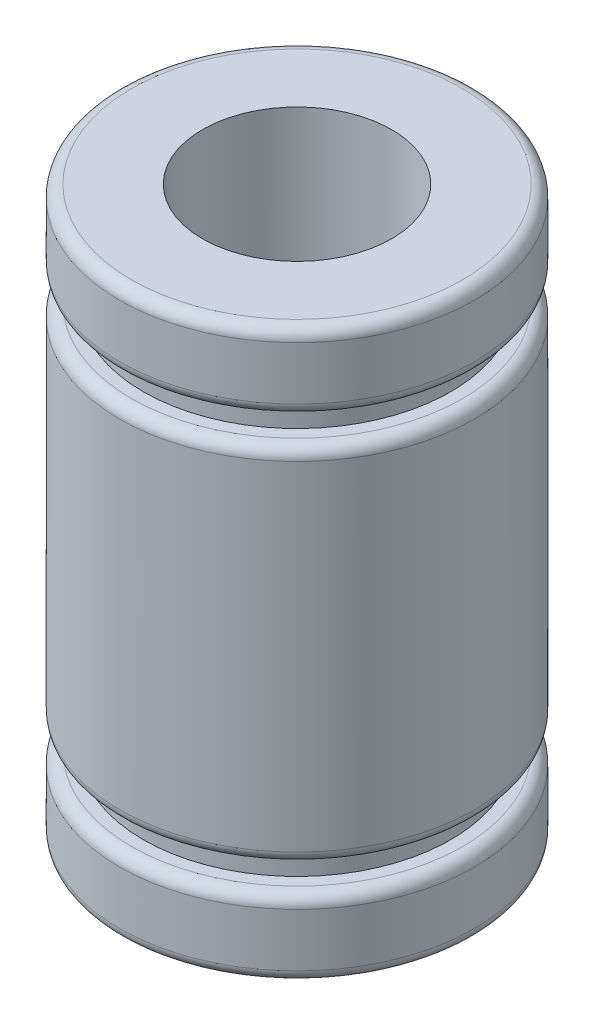
ISO-10303-21;
HEADER;
FILE_DESCRIPTION(('STEP AP214'),'2;1');
FILE_NAME('part.step','',(''),(''),'','','');
FILE_SCHEMA(('AUTOMOTIVE_DESIGN { 1 0 10303 214 1 1 1 1 }'));
ENDSEC;
DATA;
#1=APPLICATION_CONTEXT('core data for automotive mechanical design processes');
#2=APPLICATION_PROTOCOL_DEFINITION('international standard','automotive_design',2000,#1);
#3=PRODUCT_CONTEXT('',#1,'mechanical');
#4=PRODUCT('Part','Part','',(#3));
#5=PRODUCT_RELATED_PRODUCT_CATEGORY('part','',(#4));
#6=PRODUCT_DEFINITION_FORMATION('','',#4);
#7=PRODUCT_DEFINITION_CONTEXT('part definition',#1,'design');
#8=PRODUCT_DEFINITION('design','',#6,#7);
#9=PRODUCT_DEFINITION_SHAPE('','',#8);
#10=(LENGTH_UNIT() NAMED_UNIT(*) SI_UNIT(.MILLI.,.METRE.));
#11=(NAMED_UNIT(*) PLANE_ANGLE_UNIT() SI_UNIT($,.RADIAN.));
#12=(NAMED_UNIT(*) SI_UNIT($,.STERADIAN.) SOLID_ANGLE_UNIT());
#13=UNCERTAINTY_MEASURE_WITH_UNIT(LENGTH_MEASURE(1.E-05),#10,'distance_accuracy_value','');
#14=(GEOMETRIC_REPRESENTATION_CONTEXT(3) GLOBAL_UNCERTAINTY_ASSIGNED_CONTEXT((#13)) GLOBAL_UNIT_ASSIGNED_CONTEXT((#10,
#11,#12)) REPRESENTATION_CONTEXT('',''));
#15=CARTESIAN_POINT('',(0.,0.,0.));
#16=DIRECTION('',(0.,0.,1.));
#17=DIRECTION('',(1.,0.,0.));
#18=AXIS2_PLACEMENT_3D('',#15,#16,#17);
#19=CARTESIAN_POINT('',(0.,0.,-7.5));
#20=DIRECTION('',(0.,-1.,0.));
#21=DIRECTION('',(0.,0.,-1.));
#22=AXIS2_PLACEMENT_3D('',#19,#20,#21);
#23=PLANE('',#22);
#24=CARTESIAN_POINT('',(0.,0.,0.));
#25=DIRECTION('',(0.,-1.,0.));
#26=DIRECTION('',(0.,0.,-1.));
#27=AXIS2_PLACEMENT_3D('',#24,#25,#26);
#28=CIRCLE('',#27,7.);
#29=CARTESIAN_POINT('',(0.,0.,-7.));
#30=VERTEX_POINT('',#29);
#31=EDGE_CURVE('E72',#30,#30,#28,.T.);
#32=ORIENTED_EDGE('',*,*,#31,.T.);
#33=EDGE_LOOP('',(#32));
#34=FACE_BOUND('',#33,.T.);
#35=CARTESIAN_POINT('',(0.,0.,0.));
#36=DIRECTION('',(0.,-1.,0.));
#37=DIRECTION('',(0.,0.,-1.));
#38=AXIS2_PLACEMENT_3D('',#35,#36,#37);
#39=CIRCLE('',#38,4.);
#40=CARTESIAN_POINT('',(0.,0.,-4.));
#41=VERTEX_POINT('',#40);
#42=EDGE_CURVE('E88',#41,#41,#39,.F.);
#43=ORIENTED_EDGE('',*,*,#42,.T.);
#44=EDGE_LOOP('',(#43));
#45=FACE_BOUND('',#44,.T.);
#46=ADVANCED_FACE('F31',(#34,#45),#23,.T.);
#47=CARTESIAN_POINT('',(0.,24.,0.));
#48=DIRECTION('',(0.,1.,0.));
#49=DIRECTION('',(0.,0.,1.));
#50=AXIS2_PLACEMENT_3D('',#47,#48,#49);
#51=PLANE('',#50);
#52=CARTESIAN_POINT('',(0.,24.,0.));
#53=DIRECTION('',(0.,1.,0.));
#54=DIRECTION('',(0.,0.,1.));
#55=AXIS2_PLACEMENT_3D('',#52,#53,#54);
#56=CIRCLE('',#55,7.);
#57=CARTESIAN_POINT('',(0.,24.,7.));
#58=VERTEX_POINT('',#57);
#59=EDGE_CURVE('E63',#58,#58,#56,.T.);
#60=ORIENTED_EDGE('',*,*,#59,.T.);
#61=EDGE_LOOP('',(#60));
#62=FACE_BOUND('',#61,.T.);
#63=CARTESIAN_POINT('',(0.,24.,0.));
#64=DIRECTION('',(0.,1.,0.));
#65=DIRECTION('',(0.,0.,1.));
#66=AXIS2_PLACEMENT_3D('',#63,#64,#65);
#67=CIRCLE('',#66,4.);
#68=CARTESIAN_POINT('',(0.,24.,4.));
#69=VERTEX_POINT('',#68);
#70=EDGE_CURVE('E87',#69,#69,#67,.T.);
#71=ORIENTED_EDGE('',*,*,#70,.F.);
#72=EDGE_LOOP('',(#71));
#73=FACE_BOUND('',#72,.T.);
#74=ADVANCED_FACE('F96',(#62,#73),#51,.T.);
#75=CARTESIAN_POINT('',(0.,0.,0.));
#76=DIRECTION('',(0.,-1.,0.));
#77=DIRECTION('',(0.,0.,-1.));
#78=AXIS2_PLACEMENT_3D('',#75,#76,#77);
#79=CYLINDRICAL_SURFACE('',#78,7.5);
#80=CARTESIAN_POINT('',(0.,21.25,0.));
#81=DIRECTION('',(0.,-1.,0.));
#82=DIRECTION('',(0.,0.,-1.));
#83=AXIS2_PLACEMENT_3D('',#80,#81,#82);
#84=CIRCLE('',#83,7.5);
#85=CARTESIAN_POINT('',(0.,21.25,-7.5));
#86=VERTEX_POINT('',#85);
#87=EDGE_CURVE('E46',#86,#86,#84,.F.);
#88=ORIENTED_EDGE('',*,*,#87,.T.);
#89=EDGE_LOOP('',(#88));
#90=FACE_BOUND('',#89,.T.);
#91=CARTESIAN_POINT('',(0.,23.5,0.));
#92=DIRECTION('',(0.,1.,0.));
#93=DIRECTION('',(0.,0.,1.));
#94=AXIS2_PLACEMENT_3D('',#91,#92,#93);
#95=CIRCLE('',#94,7.5);
#96=CARTESIAN_POINT('',(0.,23.5,7.5));
#97=VERTEX_POINT('',#96);
#98=EDGE_CURVE('E66',#97,#97,#95,.F.);
#99=ORIENTED_EDGE('',*,*,#98,.T.);
#100=EDGE_LOOP('',(#99));
#101=FACE_BOUND('',#100,.T.);
#102=ADVANCED_FACE('F98',(#90,#101),#79,.T.);
#103=CARTESIAN_POINT('',(0.,20.75,-6.5));
#104=DIRECTION('',(0.,-1.,0.));
#105=DIRECTION('',(0.,0.,-1.));
#106=AXIS2_PLACEMENT_3D('',#103,#104,#105);
#107=PLANE('',#106);
#108=CARTESIAN_POINT('',(0.,20.75,0.));
#109=DIRECTION('',(0.,-1.,0.));
#110=DIRECTION('',(0.,0.,-1.));
#111=AXIS2_PLACEMENT_3D('',#108,#109,#110);
#112=CIRCLE('',#111,7.);
#113=CARTESIAN_POINT('',(0.,20.75,-7.));
#114=VERTEX_POINT('',#113);
#115=EDGE_CURVE('E51',#114,#114,#112,.T.);
#116=ORIENTED_EDGE('',*,*,#115,.T.);
#117=EDGE_LOOP('',(#116));
#118=FACE_BOUND('',#117,.T.);
#119=CARTESIAN_POINT('',(0.,20.75,0.));
#120=DIRECTION('',(0.,-1.,0.));
#121=DIRECTION('',(0.,0.,-1.));
#122=AXIS2_PLACEMENT_3D('',#119,#120,#121);
#123=CIRCLE('',#122,6.5);
#124=CARTESIAN_POINT('',(0.,20.75,-6.5));
#125=VERTEX_POINT('',#124);
#126=EDGE_CURVE('E75',#125,#125,#123,.T.);
#127=ORIENTED_EDGE('',*,*,#126,.F.);
#128=EDGE_LOOP('',(#127));
#129=FACE_BOUND('',#128,.T.);
#130=ADVANCED_FACE('F105',(#118,#129),#107,.T.);
#131=CARTESIAN_POINT('',(0.,0.,0.));
#132=DIRECTION('',(0.,-1.,0.));
#133=DIRECTION('',(0.,0.,-1.));
#134=AXIS2_PLACEMENT_3D('',#131,#132,#133);
#135=CYLINDRICAL_SURFACE('',#134,6.5);
#136=ORIENTED_EDGE('',*,*,#126,.T.);
#137=EDGE_LOOP('',(#136));
#138=FACE_BOUND('',#137,.T.);
#139=CARTESIAN_POINT('',(0.,19.65,0.));
#140=DIRECTION('',(0.,-1.,0.));
#141=DIRECTION('',(0.,0.,-1.));
#142=AXIS2_PLACEMENT_3D('',#139,#140,#141);
#143=CIRCLE('',#142,6.5);
#144=CARTESIAN_POINT('',(0.,19.65,-6.5));
#145=VERTEX_POINT('',#144);
#146=EDGE_CURVE('E78',#145,#145,#143,.T.);
#147=ORIENTED_EDGE('',*,*,#146,.F.);
#148=EDGE_LOOP('',(#147));
#149=FACE_BOUND('',#148,.T.);
#150=ADVANCED_FACE('F167',(#138,#149),#135,.T.);
#151=CARTESIAN_POINT('',(0.,19.65,-6.5));
#152=DIRECTION('',(0.,1.,0.));
#153=DIRECTION('',(0.,0.,1.));
#154=AXIS2_PLACEMENT_3D('',#151,#152,#153);
#155=PLANE('',#154);
#156=CARTESIAN_POINT('',(0.,19.65,0.));
#157=DIRECTION('',(0.,1.,0.));
#158=DIRECTION('',(0.,0.,1.));
#159=AXIS2_PLACEMENT_3D('',#156,#157,#158);
#160=CIRCLE('',#159,7.);
#161=CARTESIAN_POINT('',(0.,19.65,7.));
#162=VERTEX_POINT('',#161);
#163=EDGE_CURVE('E54',#162,#162,#160,.T.);
#164=ORIENTED_EDGE('',*,*,#163,.T.);
#165=EDGE_LOOP('',(#164));
#166=FACE_BOUND('',#165,.T.);
#167=ORIENTED_EDGE('',*,*,#146,.T.);
#168=EDGE_LOOP('',(#167));
#169=FACE_BOUND('',#168,.T.);
#170=ADVANCED_FACE('F163',(#166,#169),#155,.T.);
#171=CARTESIAN_POINT('',(0.,0.,0.));
#172=DIRECTION('',(0.,-1.,0.));
#173=DIRECTION('',(0.,0.,-1.));
#174=AXIS2_PLACEMENT_3D('',#171,#172,#173);
#175=CYLINDRICAL_SURFACE('',#174,7.5);
#176=CARTESIAN_POINT('',(0.,19.15,0.));
#177=DIRECTION('',(0.,1.,0.));
#178=DIRECTION('',(0.,0.,1.));
#179=AXIS2_PLACEMENT_3D('',#176,#177,#178);
#180=CIRCLE('',#179,7.5);
#181=CARTESIAN_POINT('',(0.,19.15,7.5));
#182=VERTEX_POINT('',#181);
#183=EDGE_CURVE('E57',#182,#182,#180,.F.);
#184=ORIENTED_EDGE('',*,*,#183,.T.);
#185=EDGE_LOOP('',(#184));
#186=FACE_BOUND('',#185,.T.);
#187=CARTESIAN_POINT('',(0.,4.85,0.));
#188=DIRECTION('',(0.,-1.,0.));
#189=DIRECTION('',(0.,0.,-1.));
#190=AXIS2_PLACEMENT_3D('',#187,#188,#189);
#191=CIRCLE('',#190,7.5);
#192=CARTESIAN_POINT('',(0.,4.85,-7.5));
#193=VERTEX_POINT('',#192);
#194=EDGE_CURVE('E60',#193,#193,#191,.F.);
#195=ORIENTED_EDGE('',*,*,#194,.T.);
#196=EDGE_LOOP('',(#195));
#197=FACE_BOUND('',#196,.T.);
#198=ADVANCED_FACE('F142',(#186,#197),#175,.T.);
#199=CARTESIAN_POINT('',(0.,4.35,-6.5));
#200=DIRECTION('',(0.,-1.,0.));
#201=DIRECTION('',(0.,0.,-1.));
#202=AXIS2_PLACEMENT_3D('',#199,#200,#201);
#203=PLANE('',#202);
#204=CARTESIAN_POINT('',(0.,4.35,0.));
#205=DIRECTION('',(0.,-1.,0.));
#206=DIRECTION('',(0.,0.,-1.));
#207=AXIS2_PLACEMENT_3D('',#204,#205,#206);
#208=CIRCLE('',#207,7.);
#209=CARTESIAN_POINT('',(0.,4.35,-7.));
#210=VERTEX_POINT('',#209);
#211=EDGE_CURVE('E42',#210,#210,#208,.T.);
#212=ORIENTED_EDGE('',*,*,#211,.T.);
#213=EDGE_LOOP('',(#212));
#214=FACE_BOUND('',#213,.T.);
#215=CARTESIAN_POINT('',(0.,4.35,0.));
#216=DIRECTION('',(0.,-1.,0.));
#217=DIRECTION('',(0.,0.,-1.));
#218=AXIS2_PLACEMENT_3D('',#215,#216,#217);
#219=CIRCLE('',#218,6.5);
#220=CARTESIAN_POINT('',(0.,4.35,-6.5));
#221=VERTEX_POINT('',#220);
#222=EDGE_CURVE('E81',#221,#221,#219,.T.);
#223=ORIENTED_EDGE('',*,*,#222,.F.);
#224=EDGE_LOOP('',(#223));
#225=FACE_BOUND('',#224,.T.);
#226=ADVANCED_FACE('F138',(#214,#225),#203,.T.);
#227=CARTESIAN_POINT('',(0.,0.,0.));
#228=DIRECTION('',(0.,-1.,0.));
#229=DIRECTION('',(0.,0.,-1.));
#230=AXIS2_PLACEMENT_3D('',#227,#228,#229);
#231=CYLINDRICAL_SURFACE('',#230,6.5);
#232=ORIENTED_EDGE('',*,*,#222,.T.);
#233=EDGE_LOOP('',(#232));
#234=FACE_BOUND('',#233,.T.);
#235=CARTESIAN_POINT('',(0.,3.25,0.));
#236=DIRECTION('',(0.,-1.,0.));
#237=DIRECTION('',(0.,0.,-1.));
#238=AXIS2_PLACEMENT_3D('',#235,#236,#237);
#239=CIRCLE('',#238,6.5);
#240=CARTESIAN_POINT('',(0.,3.25,-6.5));
#241=VERTEX_POINT('',#240);
#242=EDGE_CURVE('E84',#241,#241,#239,.T.);
#243=ORIENTED_EDGE('',*,*,#242,.F.);
#244=EDGE_LOOP('',(#243));
#245=FACE_BOUND('',#244,.T.);
#246=ADVANCED_FACE('F141',(#234,#245),#231,.T.);
#247=CARTESIAN_POINT('',(0.,3.25,-6.5));
#248=DIRECTION('',(0.,1.,0.));
#249=DIRECTION('',(0.,0.,1.));
#250=AXIS2_PLACEMENT_3D('',#247,#248,#249);
#251=PLANE('',#250);
#252=CARTESIAN_POINT('',(0.,3.25,0.));
#253=DIRECTION('',(0.,1.,0.));
#254=DIRECTION('',(0.,0.,1.));
#255=AXIS2_PLACEMENT_3D('',#252,#253,#254);
#256=CIRCLE('',#255,7.);
#257=CARTESIAN_POINT('',(0.,3.25,7.));
#258=VERTEX_POINT('',#257);
#259=EDGE_CURVE('E10',#258,#258,#256,.T.);
#260=ORIENTED_EDGE('',*,*,#259,.T.);
#261=EDGE_LOOP('',(#260));
#262=FACE_BOUND('',#261,.T.);
#263=ORIENTED_EDGE('',*,*,#242,.T.);
#264=EDGE_LOOP('',(#263));
#265=FACE_BOUND('',#264,.T.);
#266=ADVANCED_FACE('F148',(#262,#265),#251,.T.);
#267=CARTESIAN_POINT('',(0.,0.,0.));
#268=DIRECTION('',(0.,-1.,0.));
#269=DIRECTION('',(0.,0.,-1.));
#270=AXIS2_PLACEMENT_3D('',#267,#268,#269);
#271=CYLINDRICAL_SURFACE('',#270,7.5);
#272=CARTESIAN_POINT('',(0.,2.75,0.));
#273=DIRECTION('',(0.,1.,0.));
#274=DIRECTION('',(0.,0.,1.));
#275=AXIS2_PLACEMENT_3D('',#272,#273,#274);
#276=CIRCLE('',#275,7.5);
#277=CARTESIAN_POINT('',(0.,2.75,7.5));
#278=VERTEX_POINT('',#277);
#279=EDGE_CURVE('E38',#278,#278,#276,.F.);
#280=ORIENTED_EDGE('',*,*,#279,.T.);
#281=EDGE_LOOP('',(#280));
#282=FACE_BOUND('',#281,.T.);
#283=CARTESIAN_POINT('',(0.,0.5,0.));
#284=DIRECTION('',(0.,-1.,0.));
#285=DIRECTION('',(0.,0.,-1.));
#286=AXIS2_PLACEMENT_3D('',#283,#284,#285);
#287=CIRCLE('',#286,7.5);
#288=CARTESIAN_POINT('',(0.,0.5,-7.5));
#289=VERTEX_POINT('',#288);
#290=EDGE_CURVE('E69',#289,#289,#287,.F.);
#291=ORIENTED_EDGE('',*,*,#290,.T.);
#292=EDGE_LOOP('',(#291));
#293=FACE_BOUND('',#292,.T.);
#294=ADVANCED_FACE('F153',(#282,#293),#271,.T.);
#295=CARTESIAN_POINT('',(0.,-0.001000000000001,0.));
#296=DIRECTION('',(0.,1.,0.));
#297=DIRECTION('',(0.,0.,1.));
#298=AXIS2_PLACEMENT_3D('',#295,#296,#297);
#299=CYLINDRICAL_SURFACE('',#298,4.);
#300=ORIENTED_EDGE('',*,*,#42,.F.);
#301=EDGE_LOOP('',(#300));
#302=FACE_BOUND('',#301,.T.);
#303=ORIENTED_EDGE('',*,*,#70,.T.);
#304=EDGE_LOOP('',(#303));
#305=FACE_BOUND('',#304,.T.);
#306=ADVANCED_FACE('F94',(#302,#305),#299,.F.);
#307=CARTESIAN_POINT('',(0.,0.5,0.));
#308=DIRECTION('',(0.,-1.,0.));
#309=DIRECTION('',(0.,0.,-1.));
#310=AXIS2_PLACEMENT_3D('',#307,#308,#309);
#311=TOROIDAL_SURFACE('',#310,7.,0.5);
#312=ORIENTED_EDGE('',*,*,#290,.F.);
#313=EDGE_LOOP('',(#312));
#314=FACE_BOUND('',#313,.T.);
#315=ORIENTED_EDGE('',*,*,#31,.F.);
#316=EDGE_LOOP('',(#315));
#317=FACE_BOUND('',#316,.T.);
#318=ADVANCED_FACE('F112',(#314,#317),#311,.T.);
#319=CARTESIAN_POINT('',(0.,23.5,0.));
#320=DIRECTION('',(0.,1.,0.));
#321=DIRECTION('',(0.,0.,1.));
#322=AXIS2_PLACEMENT_3D('',#319,#320,#321);
#323=TOROIDAL_SURFACE('',#322,7.,0.5);
#324=ORIENTED_EDGE('',*,*,#59,.F.);
#325=EDGE_LOOP('',(#324));
#326=FACE_BOUND('',#325,.T.);
#327=ORIENTED_EDGE('',*,*,#98,.F.);
#328=EDGE_LOOP('',(#327));
#329=FACE_BOUND('',#328,.T.);
#330=ADVANCED_FACE('F115',(#326,#329),#323,.T.);
#331=CARTESIAN_POINT('',(0.,19.15,0.));
#332=DIRECTION('',(0.,1.,0.));
#333=DIRECTION('',(0.,0.,1.));
#334=AXIS2_PLACEMENT_3D('',#331,#332,#333);
#335=TOROIDAL_SURFACE('',#334,7.,0.5);
#336=ORIENTED_EDGE('',*,*,#163,.F.);
#337=EDGE_LOOP('',(#336));
#338=FACE_BOUND('',#337,.T.);
#339=ORIENTED_EDGE('',*,*,#183,.F.);
#340=EDGE_LOOP('',(#339));
#341=FACE_BOUND('',#340,.T.);
#342=ADVANCED_FACE('F119',(#338,#341),#335,.T.);
#343=CARTESIAN_POINT('',(0.,21.25,0.));
#344=DIRECTION('',(0.,-1.,0.));
#345=DIRECTION('',(0.,0.,-1.));
#346=AXIS2_PLACEMENT_3D('',#343,#344,#345);
#347=TOROIDAL_SURFACE('',#346,7.,0.5);
#348=ORIENTED_EDGE('',*,*,#87,.F.);
#349=EDGE_LOOP('',(#348));
#350=FACE_BOUND('',#349,.T.);
#351=ORIENTED_EDGE('',*,*,#115,.F.);
#352=EDGE_LOOP('',(#351));
#353=FACE_BOUND('',#352,.T.);
#354=ADVANCED_FACE('F123',(#350,#353),#347,.T.);
#355=CARTESIAN_POINT('',(0.,4.85,0.));
#356=DIRECTION('',(0.,-1.,0.));
#357=DIRECTION('',(0.,0.,-1.));
#358=AXIS2_PLACEMENT_3D('',#355,#356,#357);
#359=TOROIDAL_SURFACE('',#358,7.,0.5);
#360=ORIENTED_EDGE('',*,*,#194,.F.);
#361=EDGE_LOOP('',(#360));
#362=FACE_BOUND('',#361,.T.);
#363=ORIENTED_EDGE('',*,*,#211,.F.);
#364=EDGE_LOOP('',(#363));
#365=FACE_BOUND('',#364,.T.);
#366=ADVANCED_FACE('F126',(#362,#365),#359,.T.);
#367=CARTESIAN_POINT('',(0.,2.75,0.));
#368=DIRECTION('',(0.,1.,0.));
#369=DIRECTION('',(0.,0.,1.));
#370=AXIS2_PLACEMENT_3D('',#367,#368,#369);
#371=TOROIDAL_SURFACE('',#370,7.,0.5);
#372=ORIENTED_EDGE('',*,*,#259,.F.);
#373=EDGE_LOOP('',(#372));
#374=FACE_BOUND('',#373,.T.);
#375=ORIENTED_EDGE('',*,*,#279,.F.);
#376=EDGE_LOOP('',(#375));
#377=FACE_BOUND('',#376,.T.);
#378=ADVANCED_FACE('F33',(#374,#377),#371,.T.);
#379=CLOSED_SHELL('',(#46,#74,#102,#130,#150,#170,#198,#226,#246,#266,#294,#306,#318,#330,#342,
#354,#366,#378));
#380=MANIFOLD_SOLID_BREP('B2',#379);
#381=ADVANCED_BREP_SHAPE_REPRESENTATION('',(#18,#380),#14);
#382=SHAPE_DEFINITION_REPRESENTATION(#9,#381);
ENDSEC;
END-ISO-10303-21;
